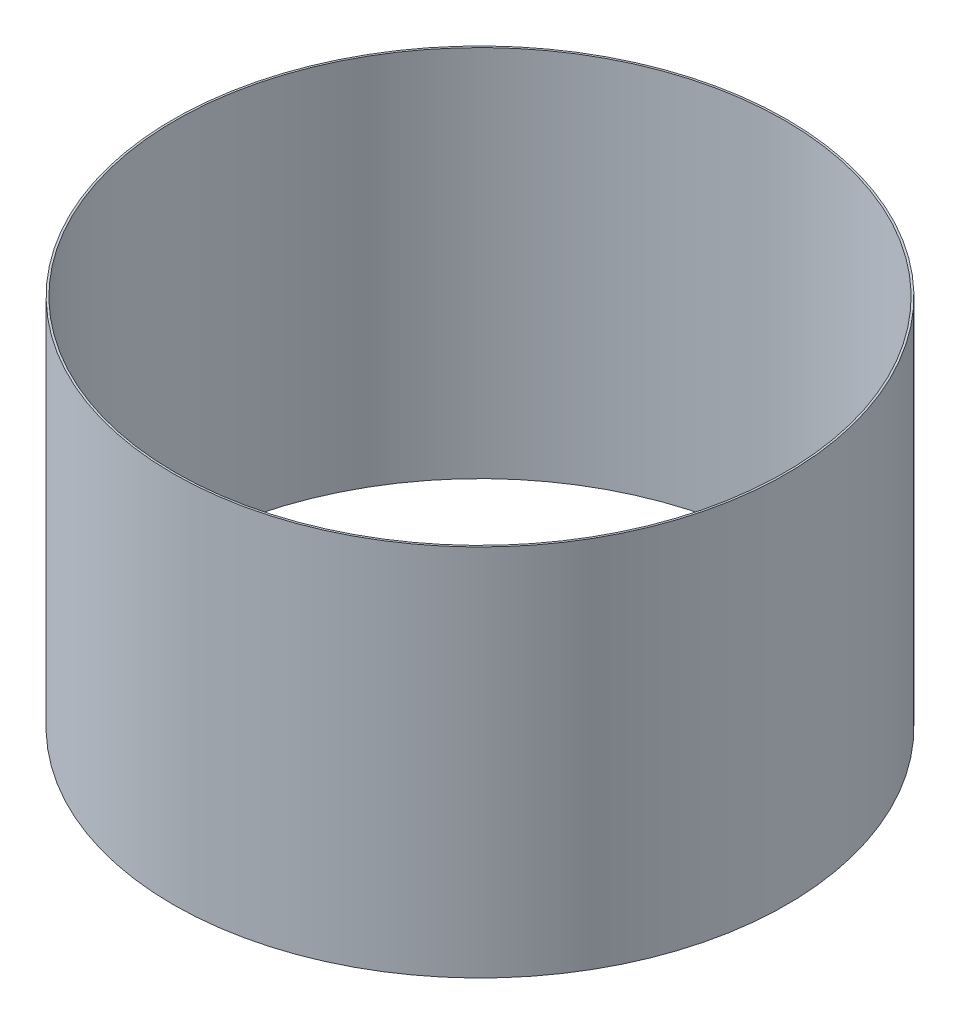
ISO-10303-21;
HEADER;
FILE_DESCRIPTION(('STEP AP214'),'2;1');
FILE_NAME('part.step','',(''),(''),'','','');
FILE_SCHEMA(('AUTOMOTIVE_DESIGN { 1 0 10303 214 1 1 1 1 }'));
ENDSEC;
DATA;
#1=APPLICATION_CONTEXT('core data for automotive mechanical design processes');
#2=APPLICATION_PROTOCOL_DEFINITION('international standard','automotive_design',2000,#1);
#3=PRODUCT_CONTEXT('',#1,'mechanical');
#4=PRODUCT('Part','Part','',(#3));
#5=PRODUCT_RELATED_PRODUCT_CATEGORY('part','',(#4));
#6=PRODUCT_DEFINITION_FORMATION('','',#4);
#7=PRODUCT_DEFINITION_CONTEXT('part definition',#1,'design');
#8=PRODUCT_DEFINITION('design','',#6,#7);
#9=PRODUCT_DEFINITION_SHAPE('','',#8);
#10=(LENGTH_UNIT() NAMED_UNIT(*) SI_UNIT(.MILLI.,.METRE.));
#11=(NAMED_UNIT(*) PLANE_ANGLE_UNIT() SI_UNIT($,.RADIAN.));
#12=(NAMED_UNIT(*) SI_UNIT($,.STERADIAN.) SOLID_ANGLE_UNIT());
#13=UNCERTAINTY_MEASURE_WITH_UNIT(LENGTH_MEASURE(1.E-05),#10,'distance_accuracy_value','');
#14=(GEOMETRIC_REPRESENTATION_CONTEXT(3) GLOBAL_UNCERTAINTY_ASSIGNED_CONTEXT((#13)) GLOBAL_UNIT_ASSIGNED_CONTEXT((#10,
#11,#12)) REPRESENTATION_CONTEXT('',''));
#15=CARTESIAN_POINT('',(0.,0.,0.));
#16=DIRECTION('',(0.,0.,1.));
#17=DIRECTION('',(1.,0.,0.));
#18=AXIS2_PLACEMENT_3D('',#15,#16,#17);
#19=CARTESIAN_POINT('',(0.,152.4,0.));
#20=DIRECTION('',(0.,-1.,0.));
#21=DIRECTION('',(0.,0.,-1.));
#22=AXIS2_PLACEMENT_3D('',#19,#20,#21);
#23=CYLINDRICAL_SURFACE('',#22,125.25375);
#24=CARTESIAN_POINT('',(0.,152.4,0.));
#25=DIRECTION('',(0.,1.,0.));
#26=DIRECTION('',(0.,0.,1.));
#27=AXIS2_PLACEMENT_3D('',#24,#25,#26);
#28=CIRCLE('',#27,125.25375);
#29=CARTESIAN_POINT('',(0.,152.4,125.25375));
#30=VERTEX_POINT('',#29);
#31=EDGE_CURVE('E10',#30,#30,#28,.T.);
#32=ORIENTED_EDGE('',*,*,#31,.F.);
#33=EDGE_LOOP('',(#32));
#34=FACE_BOUND('',#33,.T.);
#35=CARTESIAN_POINT('',(0.,0.,0.));
#36=DIRECTION('',(0.,1.,0.));
#37=DIRECTION('',(0.,0.,1.));
#38=AXIS2_PLACEMENT_3D('',#35,#36,#37);
#39=CIRCLE('',#38,125.25375);
#40=CARTESIAN_POINT('',(0.,0.,125.25375));
#41=VERTEX_POINT('',#40);
#42=EDGE_CURVE('E35',#41,#41,#39,.T.);
#43=ORIENTED_EDGE('',*,*,#42,.T.);
#44=EDGE_LOOP('',(#43));
#45=FACE_BOUND('',#44,.T.);
#46=ADVANCED_FACE('F32',(#34,#45),#23,.T.);
#47=CARTESIAN_POINT('',(0.,152.4,0.));
#48=DIRECTION('',(0.,1.,0.));
#49=DIRECTION('',(0.,0.,1.));
#50=AXIS2_PLACEMENT_3D('',#47,#48,#49);
#51=PLANE('',#50);
#52=CARTESIAN_POINT('',(0.,152.4,0.));
#53=DIRECTION('',(0.,-1.,0.));
#54=DIRECTION('',(0.,0.,-1.));
#55=AXIS2_PLACEMENT_3D('',#52,#53,#54);
#56=CIRCLE('',#55,124.46);
#57=CARTESIAN_POINT('',(0.,152.4,-124.46));
#58=VERTEX_POINT('',#57);
#59=EDGE_CURVE('E42',#58,#58,#56,.T.);
#60=ORIENTED_EDGE('',*,*,#59,.T.);
#61=EDGE_LOOP('',(#60));
#62=FACE_BOUND('',#61,.T.);
#63=ORIENTED_EDGE('',*,*,#31,.T.);
#64=EDGE_LOOP('',(#63));
#65=FACE_BOUND('',#64,.T.);
#66=ADVANCED_FACE('F50',(#62,#65),#51,.T.);
#67=CARTESIAN_POINT('',(0.,0.,0.));
#68=DIRECTION('',(0.,1.,0.));
#69=DIRECTION('',(0.,0.,1.));
#70=AXIS2_PLACEMENT_3D('',#67,#68,#69);
#71=PLANE('',#70);
#72=CARTESIAN_POINT('',(0.,0.,0.));
#73=DIRECTION('',(0.,-1.,0.));
#74=DIRECTION('',(0.,0.,-1.));
#75=AXIS2_PLACEMENT_3D('',#72,#73,#74);
#76=CIRCLE('',#75,124.46);
#77=CARTESIAN_POINT('',(0.,0.,-124.46));
#78=VERTEX_POINT('',#77);
#79=EDGE_CURVE('E44',#78,#78,#76,.T.);
#80=ORIENTED_EDGE('',*,*,#79,.F.);
#81=EDGE_LOOP('',(#80));
#82=FACE_BOUND('',#81,.T.);
#83=ORIENTED_EDGE('',*,*,#42,.F.);
#84=EDGE_LOOP('',(#83));
#85=FACE_BOUND('',#84,.T.);
#86=ADVANCED_FACE('F55',(#82,#85),#71,.F.);
#87=CARTESIAN_POINT('',(0.,152.4,0.));
#88=DIRECTION('',(0.,-1.,0.));
#89=DIRECTION('',(0.,0.,-1.));
#90=AXIS2_PLACEMENT_3D('',#87,#88,#89);
#91=CYLINDRICAL_SURFACE('',#90,124.46);
#92=ORIENTED_EDGE('',*,*,#59,.F.);
#93=EDGE_LOOP('',(#92));
#94=FACE_BOUND('',#93,.T.);
#95=ORIENTED_EDGE('',*,*,#79,.T.);
#96=EDGE_LOOP('',(#95));
#97=FACE_BOUND('',#96,.T.);
#98=ADVANCED_FACE('F52',(#94,#97),#91,.F.);
#99=CLOSED_SHELL('',(#46,#66,#86,#98));
#100=MANIFOLD_SOLID_BREP('B2',#99);
#101=ADVANCED_BREP_SHAPE_REPRESENTATION('',(#18,#100),#14);
#102=SHAPE_DEFINITION_REPRESENTATION(#9,#101);
ENDSEC;
END-ISO-10303-21;
